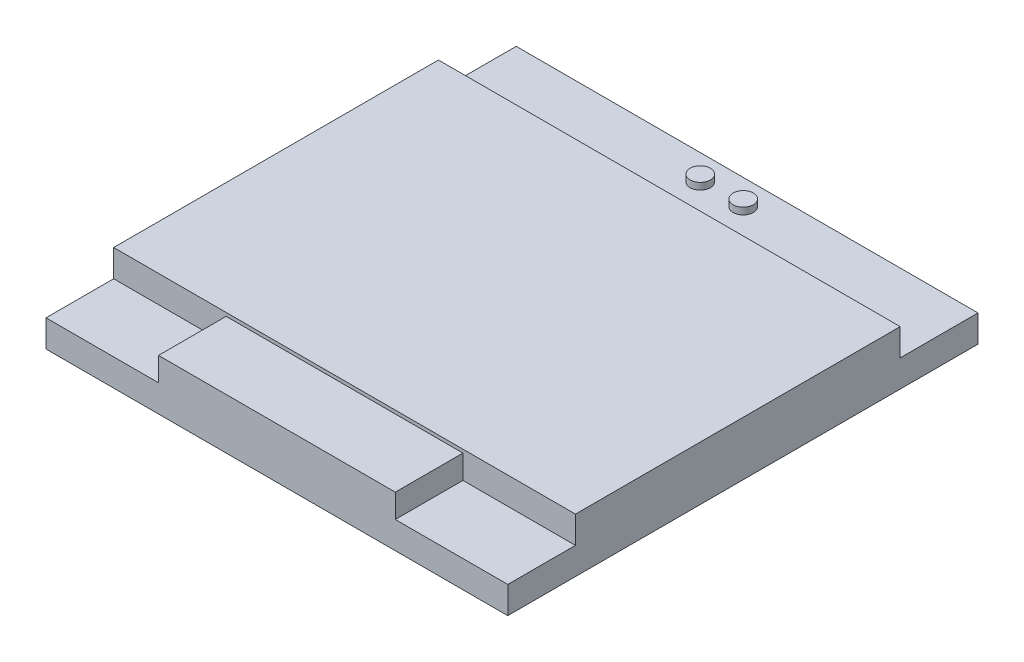
ISO-10303-21;
HEADER;
FILE_DESCRIPTION(('STEP AP214'),'2;1');
FILE_NAME('part.step','',(''),(''),'','','');
FILE_SCHEMA(('AUTOMOTIVE_DESIGN { 1 0 10303 214 1 1 1 1 }'));
ENDSEC;
DATA;
#1=APPLICATION_CONTEXT('core data for automotive mechanical design processes');
#2=APPLICATION_PROTOCOL_DEFINITION('international standard','automotive_design',2000,#1);
#3=PRODUCT_CONTEXT('',#1,'mechanical');
#4=PRODUCT('Part','Part','',(#3));
#5=PRODUCT_RELATED_PRODUCT_CATEGORY('part','',(#4));
#6=PRODUCT_DEFINITION_FORMATION('','',#4);
#7=PRODUCT_DEFINITION_CONTEXT('part definition',#1,'design');
#8=PRODUCT_DEFINITION('design','',#6,#7);
#9=PRODUCT_DEFINITION_SHAPE('','',#8);
#10=(LENGTH_UNIT() NAMED_UNIT(*) SI_UNIT(.MILLI.,.METRE.));
#11=(NAMED_UNIT(*) PLANE_ANGLE_UNIT() SI_UNIT($,.RADIAN.));
#12=(NAMED_UNIT(*) SI_UNIT($,.STERADIAN.) SOLID_ANGLE_UNIT());
#13=UNCERTAINTY_MEASURE_WITH_UNIT(LENGTH_MEASURE(1.E-05),#10,'distance_accuracy_value','');
#14=(GEOMETRIC_REPRESENTATION_CONTEXT(3) GLOBAL_UNCERTAINTY_ASSIGNED_CONTEXT((#13)) GLOBAL_UNIT_ASSIGNED_CONTEXT((#10,
#11,#12)) REPRESENTATION_CONTEXT('',''));
#15=CARTESIAN_POINT('',(0.,0.,0.));
#16=DIRECTION('',(0.,0.,1.));
#17=DIRECTION('',(1.,0.,0.));
#18=AXIS2_PLACEMENT_3D('',#15,#16,#17);
#19=CARTESIAN_POINT('',(0.,1.6,0.));
#20=DIRECTION('',(0.,-1.,0.));
#21=DIRECTION('',(0.,0.,-1.));
#22=AXIS2_PLACEMENT_3D('',#19,#20,#21);
#23=PLANE('',#22);
#24=DIRECTION('',(0.,0.,1.));
#25=VECTOR('',#24,1.);
#26=CARTESIAN_POINT('',(6.65,1.6,-4.));
#27=LINE('',#26,#25);
#28=CARTESIAN_POINT('',(6.65,1.6,-4.));
#29=VERTEX_POINT('',#28);
#30=CARTESIAN_POINT('',(6.65,1.6,0.));
#31=VERTEX_POINT('',#30);
#32=EDGE_CURVE('E142',#29,#31,#27,.T.);
#33=ORIENTED_EDGE('',*,*,#32,.F.);
#34=DIRECTION('',(1.,0.,0.));
#35=VECTOR('',#34,1.);
#36=CARTESIAN_POINT('',(0.,1.6,-4.));
#37=LINE('',#36,#35);
#38=CARTESIAN_POINT('',(0.,1.6,-4.));
#39=VERTEX_POINT('',#38);
#40=EDGE_CURVE('E170',#39,#29,#37,.T.);
#41=ORIENTED_EDGE('',*,*,#40,.F.);
#42=DIRECTION('',(0.,0.,1.));
#43=VECTOR('',#42,1.);
#44=CARTESIAN_POINT('',(0.,1.6,0.));
#45=LINE('',#44,#43);
#46=CARTESIAN_POINT('',(0.,1.6,0.));
#47=VERTEX_POINT('',#46);
#48=EDGE_CURVE('E208',#39,#47,#45,.T.);
#49=ORIENTED_EDGE('',*,*,#48,.T.);
#50=DIRECTION('',(1.,0.,0.));
#51=VECTOR('',#50,1.);
#52=CARTESIAN_POINT('',(0.,1.6,0.));
#53=LINE('',#52,#51);
#54=EDGE_CURVE('E209',#47,#31,#53,.T.);
#55=ORIENTED_EDGE('',*,*,#54,.T.);
#56=EDGE_LOOP('',(#33,#41,#49,#55));
#57=FACE_BOUND('',#56,.T.);
#58=ADVANCED_FACE('F39',(#57),#23,.F.);
#59=DIRECTION('',(0.,0.,-1.));
#60=VECTOR('',#59,1.);
#61=CARTESIAN_POINT('',(20.65,1.6,-4.));
#62=LINE('',#61,#60);
#63=CARTESIAN_POINT('',(20.65,1.6,0.));
#64=VERTEX_POINT('',#63);
#65=CARTESIAN_POINT('',(20.65,1.6,-4.));
#66=VERTEX_POINT('',#65);
#67=EDGE_CURVE('E155',#64,#66,#62,.T.);
#68=ORIENTED_EDGE('',*,*,#67,.F.);
#69=CARTESIAN_POINT('',(27.3,1.6,0.));
#70=VERTEX_POINT('',#69);
#71=EDGE_CURVE('E207',#64,#70,#53,.T.);
#72=ORIENTED_EDGE('',*,*,#71,.T.);
#73=DIRECTION('',(0.,0.,-1.));
#74=VECTOR('',#73,1.);
#75=CARTESIAN_POINT('',(27.3,1.6,0.));
#76=LINE('',#75,#74);
#77=CARTESIAN_POINT('',(27.3,1.6,-4.));
#78=VERTEX_POINT('',#77);
#79=EDGE_CURVE('E212',#70,#78,#76,.T.);
#80=ORIENTED_EDGE('',*,*,#79,.T.);
#81=EDGE_CURVE('E173',#66,#78,#37,.T.);
#82=ORIENTED_EDGE('',*,*,#81,.F.);
#83=EDGE_LOOP('',(#68,#72,#80,#82));
#84=FACE_BOUND('',#83,.T.);
#85=ADVANCED_FACE('F291',(#84),#23,.F.);
#86=CARTESIAN_POINT('',(0.,3.2,-4.));
#87=DIRECTION('',(0.,0.,-1.));
#88=DIRECTION('',(-1.,0.,0.));
#89=AXIS2_PLACEMENT_3D('',#86,#87,#88);
#90=PLANE('',#89);
#91=DIRECTION('',(0.,-1.,0.));
#92=VECTOR('',#91,1.);
#93=CARTESIAN_POINT('',(6.65,17.760219778561,-4.));
#94=LINE('',#93,#92);
#95=CARTESIAN_POINT('',(6.65,3.,-4.));
#96=VERTEX_POINT('',#95);
#97=EDGE_CURVE('E158',#96,#29,#94,.T.);
#98=ORIENTED_EDGE('',*,*,#97,.F.);
#99=DIRECTION('',(-1.,0.,0.));
#100=VECTOR('',#99,1.);
#101=CARTESIAN_POINT('',(6.65,3.,-4.));
#102=LINE('',#101,#100);
#103=CARTESIAN_POINT('',(20.65,3.,-4.));
#104=VERTEX_POINT('',#103);
#105=EDGE_CURVE('E147',#104,#96,#102,.T.);
#106=ORIENTED_EDGE('',*,*,#105,.F.);
#107=DIRECTION('',(0.,-1.,0.));
#108=VECTOR('',#107,1.);
#109=CARTESIAN_POINT('',(20.65,17.760219778561,-4.));
#110=LINE('',#109,#108);
#111=EDGE_CURVE('E150',#104,#66,#110,.T.);
#112=ORIENTED_EDGE('',*,*,#111,.T.);
#113=ORIENTED_EDGE('',*,*,#81,.T.);
#114=DIRECTION('',(0.,-1.,0.));
#115=VECTOR('',#114,1.);
#116=CARTESIAN_POINT('',(27.3,3.2,-4.));
#117=LINE('',#116,#115);
#118=CARTESIAN_POINT('',(27.3,3.2,-4.));
#119=VERTEX_POINT('',#118);
#120=EDGE_CURVE('E180',#119,#78,#117,.T.);
#121=ORIENTED_EDGE('',*,*,#120,.F.);
#122=DIRECTION('',(1.,0.,0.));
#123=VECTOR('',#122,1.);
#124=CARTESIAN_POINT('',(0.,3.2,-4.));
#125=LINE('',#124,#123);
#126=CARTESIAN_POINT('',(0.,3.2,-4.));
#127=VERTEX_POINT('',#126);
#128=EDGE_CURVE('E163',#127,#119,#125,.T.);
#129=ORIENTED_EDGE('',*,*,#128,.F.);
#130=DIRECTION('',(0.,-1.,0.));
#131=VECTOR('',#130,1.);
#132=CARTESIAN_POINT('',(0.,3.2,-4.));
#133=LINE('',#132,#131);
#134=EDGE_CURVE('E183',#127,#39,#133,.T.);
#135=ORIENTED_EDGE('',*,*,#134,.T.);
#136=ORIENTED_EDGE('',*,*,#40,.T.);
#137=EDGE_LOOP('',(#98,#106,#112,#113,#121,#129,#135,#136));
#138=FACE_BOUND('',#137,.T.);
#139=ADVANCED_FACE('F269',(#138),#90,.F.);
#140=CARTESIAN_POINT('',(14.92,1.6,-26.3));
#141=DIRECTION('',(0.,-1.,0.));
#142=DIRECTION('',(0.,0.,-1.));
#143=AXIS2_PLACEMENT_3D('',#140,#141,#142);
#144=CIRCLE('',#143,0.6);
#145=CARTESIAN_POINT('',(14.92,1.6,-26.9));
#146=VERTEX_POINT('',#145);
#147=EDGE_CURVE('E201',#146,#146,#144,.T.);
#148=ORIENTED_EDGE('',*,*,#147,.T.);
#149=EDGE_LOOP('',(#148));
#150=FACE_BOUND('',#149,.T.);
#151=CARTESIAN_POINT('',(12.38,1.6,-26.3));
#152=DIRECTION('',(0.,-1.,0.));
#153=DIRECTION('',(0.,0.,-1.));
#154=AXIS2_PLACEMENT_3D('',#151,#152,#153);
#155=CIRCLE('',#154,0.6);
#156=CARTESIAN_POINT('',(12.38,1.6,-26.9));
#157=VERTEX_POINT('',#156);
#158=EDGE_CURVE('E192',#157,#157,#155,.T.);
#159=ORIENTED_EDGE('',*,*,#158,.T.);
#160=EDGE_LOOP('',(#159));
#161=FACE_BOUND('',#160,.T.);
#162=DIRECTION('',(-1.,0.,0.));
#163=VECTOR('',#162,1.);
#164=CARTESIAN_POINT('',(0.,1.6,-23.2));
#165=LINE('',#164,#163);
#166=CARTESIAN_POINT('',(27.3,1.6,-23.2));
#167=VERTEX_POINT('',#166);
#168=CARTESIAN_POINT('',(0.,1.6,-23.2));
#169=VERTEX_POINT('',#168);
#170=EDGE_CURVE('E62',#167,#169,#165,.T.);
#171=ORIENTED_EDGE('',*,*,#170,.F.);
#172=CARTESIAN_POINT('',(27.3,1.6,-27.8));
#173=VERTEX_POINT('',#172);
#174=EDGE_CURVE('E211',#167,#173,#76,.T.);
#175=ORIENTED_EDGE('',*,*,#174,.T.);
#176=DIRECTION('',(-1.,0.,0.));
#177=VECTOR('',#176,1.);
#178=CARTESIAN_POINT('',(0.,1.6,-27.8));
#179=LINE('',#178,#177);
#180=CARTESIAN_POINT('',(0.,1.6,-27.8));
#181=VERTEX_POINT('',#180);
#182=EDGE_CURVE('E215',#173,#181,#179,.T.);
#183=ORIENTED_EDGE('',*,*,#182,.T.);
#184=EDGE_CURVE('E205',#181,#169,#45,.T.);
#185=ORIENTED_EDGE('',*,*,#184,.T.);
#186=EDGE_LOOP('',(#171,#175,#183,#185));
#187=FACE_BOUND('',#186,.T.);
#188=ADVANCED_FACE('F293',(#150,#161,#187),#23,.F.);
#189=CARTESIAN_POINT('',(0.,1.6,0.));
#190=DIRECTION('',(1.,0.,0.));
#191=DIRECTION('',(0.,0.,-1.));
#192=AXIS2_PLACEMENT_3D('',#189,#190,#191);
#193=PLANE('',#192);
#194=DIRECTION('',(0.,0.,1.));
#195=VECTOR('',#194,1.);
#196=CARTESIAN_POINT('',(0.,0.,0.));
#197=LINE('',#196,#195);
#198=CARTESIAN_POINT('',(0.,0.,-27.8));
#199=VERTEX_POINT('',#198);
#200=CARTESIAN_POINT('',(0.,0.,0.));
#201=VERTEX_POINT('',#200);
#202=EDGE_CURVE('E204',#199,#201,#197,.T.);
#203=ORIENTED_EDGE('',*,*,#202,.T.);
#204=DIRECTION('',(0.,-1.,0.));
#205=VECTOR('',#204,1.);
#206=CARTESIAN_POINT('',(0.,1.6,0.));
#207=LINE('',#206,#205);
#208=EDGE_CURVE('E234',#47,#201,#207,.T.);
#209=ORIENTED_EDGE('',*,*,#208,.F.);
#210=ORIENTED_EDGE('',*,*,#48,.F.);
#211=ORIENTED_EDGE('',*,*,#134,.F.);
#212=DIRECTION('',(0.,0.,1.));
#213=VECTOR('',#212,1.);
#214=CARTESIAN_POINT('',(0.,3.2,-23.2));
#215=LINE('',#214,#213);
#216=CARTESIAN_POINT('',(0.,3.2,-23.2));
#217=VERTEX_POINT('',#216);
#218=EDGE_CURVE('E160',#217,#127,#215,.T.);
#219=ORIENTED_EDGE('',*,*,#218,.F.);
#220=DIRECTION('',(0.,-1.,0.));
#221=VECTOR('',#220,1.);
#222=CARTESIAN_POINT('',(0.,3.2,-23.2));
#223=LINE('',#222,#221);
#224=EDGE_CURVE('E169',#217,#169,#223,.T.);
#225=ORIENTED_EDGE('',*,*,#224,.T.);
#226=ORIENTED_EDGE('',*,*,#184,.F.);
#227=DIRECTION('',(0.,-1.,0.));
#228=VECTOR('',#227,1.);
#229=CARTESIAN_POINT('',(0.,1.6,-27.8));
#230=LINE('',#229,#228);
#231=EDGE_CURVE('E217',#181,#199,#230,.T.);
#232=ORIENTED_EDGE('',*,*,#231,.T.);
#233=EDGE_LOOP('',(#203,#209,#210,#211,#219,#225,#226,#232));
#234=FACE_BOUND('',#233,.T.);
#235=ADVANCED_FACE('F41',(#234),#193,.F.);
#236=CARTESIAN_POINT('',(0.,1.6,0.));
#237=DIRECTION('',(0.,0.,-1.));
#238=DIRECTION('',(-1.,0.,0.));
#239=AXIS2_PLACEMENT_3D('',#236,#237,#238);
#240=PLANE('',#239);
#241=DIRECTION('',(1.,0.,0.));
#242=VECTOR('',#241,1.);
#243=CARTESIAN_POINT('',(0.,0.,0.));
#244=LINE('',#243,#242);
#245=CARTESIAN_POINT('',(27.3,0.,0.));
#246=VERTEX_POINT('',#245);
#247=EDGE_CURVE('E220',#201,#246,#244,.T.);
#248=ORIENTED_EDGE('',*,*,#247,.T.);
#249=DIRECTION('',(0.,-1.,0.));
#250=VECTOR('',#249,1.);
#251=CARTESIAN_POINT('',(27.3,1.6,0.));
#252=LINE('',#251,#250);
#253=EDGE_CURVE('E231',#70,#246,#252,.T.);
#254=ORIENTED_EDGE('',*,*,#253,.F.);
#255=ORIENTED_EDGE('',*,*,#71,.F.);
#256=DIRECTION('',(0.,-1.,0.));
#257=VECTOR('',#256,1.);
#258=CARTESIAN_POINT('',(20.65,17.760219778561,0.));
#259=LINE('',#258,#257);
#260=CARTESIAN_POINT('',(20.65,3.,0.));
#261=VERTEX_POINT('',#260);
#262=EDGE_CURVE('E135',#261,#64,#259,.T.);
#263=ORIENTED_EDGE('',*,*,#262,.F.);
#264=DIRECTION('',(1.,0.,0.));
#265=VECTOR('',#264,1.);
#266=CARTESIAN_POINT('',(6.65,3.,0.));
#267=LINE('',#266,#265);
#268=CARTESIAN_POINT('',(6.65,3.,0.));
#269=VERTEX_POINT('',#268);
#270=EDGE_CURVE('E128',#269,#261,#267,.T.);
#271=ORIENTED_EDGE('',*,*,#270,.F.);
#272=DIRECTION('',(0.,-1.,0.));
#273=VECTOR('',#272,1.);
#274=CARTESIAN_POINT('',(6.65,17.760219778561,0.));
#275=LINE('',#274,#273);
#276=EDGE_CURVE('E132',#269,#31,#275,.T.);
#277=ORIENTED_EDGE('',*,*,#276,.T.);
#278=ORIENTED_EDGE('',*,*,#54,.F.);
#279=ORIENTED_EDGE('',*,*,#208,.T.);
#280=EDGE_LOOP('',(#248,#254,#255,#263,#271,#277,#278,#279));
#281=FACE_BOUND('',#280,.T.);
#282=ADVANCED_FACE('F130',(#281),#240,.F.);
#283=CARTESIAN_POINT('',(27.3,1.6,0.));
#284=DIRECTION('',(-1.,0.,0.));
#285=DIRECTION('',(0.,0.,1.));
#286=AXIS2_PLACEMENT_3D('',#283,#284,#285);
#287=PLANE('',#286);
#288=DIRECTION('',(0.,0.,-1.));
#289=VECTOR('',#288,1.);
#290=CARTESIAN_POINT('',(27.3,0.,0.));
#291=LINE('',#290,#289);
#292=CARTESIAN_POINT('',(27.3,0.,-27.8));
#293=VERTEX_POINT('',#292);
#294=EDGE_CURVE('E222',#246,#293,#291,.T.);
#295=ORIENTED_EDGE('',*,*,#294,.T.);
#296=DIRECTION('',(0.,-1.,0.));
#297=VECTOR('',#296,1.);
#298=CARTESIAN_POINT('',(27.3,1.6,-27.8));
#299=LINE('',#298,#297);
#300=EDGE_CURVE('E228',#173,#293,#299,.T.);
#301=ORIENTED_EDGE('',*,*,#300,.F.);
#302=ORIENTED_EDGE('',*,*,#174,.F.);
#303=DIRECTION('',(0.,-1.,0.));
#304=VECTOR('',#303,1.);
#305=CARTESIAN_POINT('',(27.3,3.2,-23.2));
#306=LINE('',#305,#304);
#307=CARTESIAN_POINT('',(27.3,3.2,-23.2));
#308=VERTEX_POINT('',#307);
#309=EDGE_CURVE('E177',#308,#167,#306,.T.);
#310=ORIENTED_EDGE('',*,*,#309,.F.);
#311=DIRECTION('',(0.,0.,-1.));
#312=VECTOR('',#311,1.);
#313=CARTESIAN_POINT('',(27.3,3.2,-23.2));
#314=LINE('',#313,#312);
#315=EDGE_CURVE('E165',#119,#308,#314,.T.);
#316=ORIENTED_EDGE('',*,*,#315,.F.);
#317=ORIENTED_EDGE('',*,*,#120,.T.);
#318=ORIENTED_EDGE('',*,*,#79,.F.);
#319=ORIENTED_EDGE('',*,*,#253,.T.);
#320=EDGE_LOOP('',(#295,#301,#302,#310,#316,#317,#318,#319));
#321=FACE_BOUND('',#320,.T.);
#322=ADVANCED_FACE('F261',(#321),#287,.F.);
#323=CARTESIAN_POINT('',(0.,1.6,-27.8));
#324=DIRECTION('',(0.,0.,1.));
#325=DIRECTION('',(1.,0.,0.));
#326=AXIS2_PLACEMENT_3D('',#323,#324,#325);
#327=PLANE('',#326);
#328=DIRECTION('',(-1.,0.,0.));
#329=VECTOR('',#328,1.);
#330=CARTESIAN_POINT('',(0.,0.,-27.8));
#331=LINE('',#330,#329);
#332=EDGE_CURVE('E224',#293,#199,#331,.T.);
#333=ORIENTED_EDGE('',*,*,#332,.T.);
#334=ORIENTED_EDGE('',*,*,#231,.F.);
#335=ORIENTED_EDGE('',*,*,#182,.F.);
#336=ORIENTED_EDGE('',*,*,#300,.T.);
#337=EDGE_LOOP('',(#333,#334,#335,#336));
#338=FACE_BOUND('',#337,.T.);
#339=ADVANCED_FACE('F246',(#338),#327,.F.);
#340=CARTESIAN_POINT('',(0.,0.,0.));
#341=DIRECTION('',(0.,-1.,0.));
#342=DIRECTION('',(0.,0.,-1.));
#343=AXIS2_PLACEMENT_3D('',#340,#341,#342);
#344=PLANE('',#343);
#345=CARTESIAN_POINT('',(12.38,0.,-26.3));
#346=DIRECTION('',(0.,-1.,0.));
#347=DIRECTION('',(0.,0.,-1.));
#348=AXIS2_PLACEMENT_3D('',#345,#346,#347);
#349=CIRCLE('',#348,0.6);
#350=CARTESIAN_POINT('',(12.38,0.,-26.9));
#351=VERTEX_POINT('',#350);
#352=EDGE_CURVE('E12',#351,#351,#349,.T.);
#353=ORIENTED_EDGE('',*,*,#352,.F.);
#354=EDGE_LOOP('',(#353));
#355=FACE_BOUND('',#354,.T.);
#356=CARTESIAN_POINT('',(14.92,0.,-26.3));
#357=DIRECTION('',(0.,-1.,0.));
#358=DIRECTION('',(0.,0.,-1.));
#359=AXIS2_PLACEMENT_3D('',#356,#357,#358);
#360=CIRCLE('',#359,0.6);
#361=CARTESIAN_POINT('',(14.92,0.,-26.9));
#362=VERTEX_POINT('',#361);
#363=EDGE_CURVE('E47',#362,#362,#360,.T.);
#364=ORIENTED_EDGE('',*,*,#363,.F.);
#365=EDGE_LOOP('',(#364));
#366=FACE_BOUND('',#365,.T.);
#367=ORIENTED_EDGE('',*,*,#202,.F.);
#368=ORIENTED_EDGE('',*,*,#332,.F.);
#369=ORIENTED_EDGE('',*,*,#294,.F.);
#370=ORIENTED_EDGE('',*,*,#247,.F.);
#371=EDGE_LOOP('',(#367,#368,#369,#370));
#372=FACE_BOUND('',#371,.T.);
#373=ADVANCED_FACE('F242',(#355,#366,#372),#344,.T.);
#374=CARTESIAN_POINT('',(0.,-4.9,0.));
#375=DIRECTION('',(0.,-1.,0.));
#376=DIRECTION('',(0.,0.,-1.));
#377=AXIS2_PLACEMENT_3D('',#374,#375,#376);
#378=PLANE('',#377);
#379=CARTESIAN_POINT('',(14.92,-4.9,-26.3));
#380=DIRECTION('',(0.,-1.,0.));
#381=DIRECTION('',(0.,0.,-1.));
#382=AXIS2_PLACEMENT_3D('',#379,#380,#381);
#383=CIRCLE('',#382,0.6);
#384=CARTESIAN_POINT('',(14.92,-4.9,-26.9));
#385=VERTEX_POINT('',#384);
#386=EDGE_CURVE('E195',#385,#385,#383,.T.);
#387=ORIENTED_EDGE('',*,*,#386,.T.);
#388=EDGE_LOOP('',(#387));
#389=FACE_BOUND('',#388,.T.);
#390=ADVANCED_FACE('F245',(#389),#378,.T.);
#391=CARTESIAN_POINT('',(14.92,2.,-26.3));
#392=DIRECTION('',(0.,-1.,0.));
#393=DIRECTION('',(0.,0.,-1.));
#394=AXIS2_PLACEMENT_3D('',#391,#392,#393);
#395=CYLINDRICAL_SURFACE('',#394,0.6);
#396=ORIENTED_EDGE('',*,*,#363,.T.);
#397=EDGE_LOOP('',(#396));
#398=FACE_BOUND('',#397,.T.);
#399=ORIENTED_EDGE('',*,*,#386,.F.);
#400=EDGE_LOOP('',(#399));
#401=FACE_BOUND('',#400,.T.);
#402=ADVANCED_FACE('F239',(#398,#401),#395,.T.);
#403=CARTESIAN_POINT('',(14.92,2.,-26.3));
#404=DIRECTION('',(0.,-1.,0.));
#405=DIRECTION('',(0.,0.,-1.));
#406=AXIS2_PLACEMENT_3D('',#403,#404,#405);
#407=CIRCLE('',#406,0.6);
#408=CARTESIAN_POINT('',(14.92,2.,-26.9));
#409=VERTEX_POINT('',#408);
#410=EDGE_CURVE('E198',#409,#409,#407,.T.);
#411=ORIENTED_EDGE('',*,*,#410,.T.);
#412=EDGE_LOOP('',(#411));
#413=FACE_BOUND('',#412,.T.);
#414=ORIENTED_EDGE('',*,*,#147,.F.);
#415=EDGE_LOOP('',(#414));
#416=FACE_BOUND('',#415,.T.);
#417=ADVANCED_FACE('F326',(#413,#416),#395,.T.);
#418=CARTESIAN_POINT('',(14.92,2.,-26.3));
#419=DIRECTION('',(0.,-1.,0.));
#420=DIRECTION('',(0.,0.,-1.));
#421=AXIS2_PLACEMENT_3D('',#418,#419,#420);
#422=PLANE('',#421);
#423=ORIENTED_EDGE('',*,*,#410,.F.);
#424=EDGE_LOOP('',(#423));
#425=FACE_BOUND('',#424,.T.);
#426=ADVANCED_FACE('F324',(#425),#422,.F.);
#427=CARTESIAN_POINT('',(0.,-4.9,0.));
#428=DIRECTION('',(0.,-1.,0.));
#429=DIRECTION('',(0.,0.,-1.));
#430=AXIS2_PLACEMENT_3D('',#427,#428,#429);
#431=PLANE('',#430);
#432=CARTESIAN_POINT('',(12.38,-4.9,-26.3));
#433=DIRECTION('',(0.,-1.,0.));
#434=DIRECTION('',(0.,0.,-1.));
#435=AXIS2_PLACEMENT_3D('',#432,#433,#434);
#436=CIRCLE('',#435,0.6);
#437=CARTESIAN_POINT('',(12.38,-4.9,-26.9));
#438=VERTEX_POINT('',#437);
#439=EDGE_CURVE('E186',#438,#438,#436,.T.);
#440=ORIENTED_EDGE('',*,*,#439,.T.);
#441=EDGE_LOOP('',(#440));
#442=FACE_BOUND('',#441,.T.);
#443=ADVANCED_FACE('F317',(#442),#431,.T.);
#444=CARTESIAN_POINT('',(12.38,2.,-26.3));
#445=DIRECTION('',(0.,-1.,0.));
#446=DIRECTION('',(0.,0.,-1.));
#447=AXIS2_PLACEMENT_3D('',#444,#445,#446);
#448=CYLINDRICAL_SURFACE('',#447,0.6);
#449=ORIENTED_EDGE('',*,*,#352,.T.);
#450=EDGE_LOOP('',(#449));
#451=FACE_BOUND('',#450,.T.);
#452=ORIENTED_EDGE('',*,*,#439,.F.);
#453=EDGE_LOOP('',(#452));
#454=FACE_BOUND('',#453,.T.);
#455=ADVANCED_FACE('F311',(#451,#454),#448,.T.);
#456=CARTESIAN_POINT('',(12.38,2.,-26.3));
#457=DIRECTION('',(0.,-1.,0.));
#458=DIRECTION('',(0.,0.,-1.));
#459=AXIS2_PLACEMENT_3D('',#456,#457,#458);
#460=CIRCLE('',#459,0.6);
#461=CARTESIAN_POINT('',(12.38,2.,-26.9));
#462=VERTEX_POINT('',#461);
#463=EDGE_CURVE('E189',#462,#462,#460,.T.);
#464=ORIENTED_EDGE('',*,*,#463,.T.);
#465=EDGE_LOOP('',(#464));
#466=FACE_BOUND('',#465,.T.);
#467=ORIENTED_EDGE('',*,*,#158,.F.);
#468=EDGE_LOOP('',(#467));
#469=FACE_BOUND('',#468,.T.);
#470=ADVANCED_FACE('F286',(#466,#469),#448,.T.);
#471=CARTESIAN_POINT('',(12.38,2.,-26.3));
#472=DIRECTION('',(0.,-1.,0.));
#473=DIRECTION('',(0.,0.,-1.));
#474=AXIS2_PLACEMENT_3D('',#471,#472,#473);
#475=PLANE('',#474);
#476=ORIENTED_EDGE('',*,*,#463,.F.);
#477=EDGE_LOOP('',(#476));
#478=FACE_BOUND('',#477,.T.);
#479=ADVANCED_FACE('F279',(#478),#475,.F.);
#480=CARTESIAN_POINT('',(0.,3.2,-23.2));
#481=DIRECTION('',(0.,0.,1.));
#482=DIRECTION('',(1.,0.,0.));
#483=AXIS2_PLACEMENT_3D('',#480,#481,#482);
#484=PLANE('',#483);
#485=ORIENTED_EDGE('',*,*,#170,.T.);
#486=ORIENTED_EDGE('',*,*,#224,.F.);
#487=DIRECTION('',(-1.,0.,0.));
#488=VECTOR('',#487,1.);
#489=CARTESIAN_POINT('',(0.,3.2,-23.2));
#490=LINE('',#489,#488);
#491=EDGE_CURVE('E167',#308,#217,#490,.T.);
#492=ORIENTED_EDGE('',*,*,#491,.F.);
#493=ORIENTED_EDGE('',*,*,#309,.T.);
#494=EDGE_LOOP('',(#485,#486,#492,#493));
#495=FACE_BOUND('',#494,.T.);
#496=ADVANCED_FACE('F277',(#495),#484,.F.);
#497=CARTESIAN_POINT('',(0.,3.2,0.));
#498=DIRECTION('',(0.,1.,0.));
#499=DIRECTION('',(0.,0.,1.));
#500=AXIS2_PLACEMENT_3D('',#497,#498,#499);
#501=PLANE('',#500);
#502=ORIENTED_EDGE('',*,*,#218,.T.);
#503=ORIENTED_EDGE('',*,*,#128,.T.);
#504=ORIENTED_EDGE('',*,*,#315,.T.);
#505=ORIENTED_EDGE('',*,*,#491,.T.);
#506=EDGE_LOOP('',(#502,#503,#504,#505));
#507=FACE_BOUND('',#506,.T.);
#508=ADVANCED_FACE('F273',(#507),#501,.T.);
#509=CARTESIAN_POINT('',(6.65,17.760219778561,-4.));
#510=DIRECTION('',(1.,0.,0.));
#511=DIRECTION('',(0.,0.,-1.));
#512=AXIS2_PLACEMENT_3D('',#509,#510,#511);
#513=PLANE('',#512);
#514=DIRECTION('',(0.,0.,1.));
#515=VECTOR('',#514,1.);
#516=CARTESIAN_POINT('',(6.65,3.,-4.));
#517=LINE('',#516,#515);
#518=EDGE_CURVE('E137',#96,#269,#517,.T.);
#519=ORIENTED_EDGE('',*,*,#518,.F.);
#520=ORIENTED_EDGE('',*,*,#97,.T.);
#521=ORIENTED_EDGE('',*,*,#32,.T.);
#522=ORIENTED_EDGE('',*,*,#276,.F.);
#523=EDGE_LOOP('',(#519,#520,#521,#522));
#524=FACE_BOUND('',#523,.T.);
#525=ADVANCED_FACE('F140',(#524),#513,.F.);
#526=CARTESIAN_POINT('',(20.65,17.760219778561,-4.));
#527=DIRECTION('',(-1.,0.,0.));
#528=DIRECTION('',(0.,0.,1.));
#529=AXIS2_PLACEMENT_3D('',#526,#527,#528);
#530=PLANE('',#529);
#531=DIRECTION('',(0.,0.,-1.));
#532=VECTOR('',#531,1.);
#533=CARTESIAN_POINT('',(20.65,3.,-4.));
#534=LINE('',#533,#532);
#535=EDGE_CURVE('E54',#261,#104,#534,.T.);
#536=ORIENTED_EDGE('',*,*,#535,.F.);
#537=ORIENTED_EDGE('',*,*,#262,.T.);
#538=ORIENTED_EDGE('',*,*,#67,.T.);
#539=ORIENTED_EDGE('',*,*,#111,.F.);
#540=EDGE_LOOP('',(#536,#537,#538,#539));
#541=FACE_BOUND('',#540,.T.);
#542=ADVANCED_FACE('F421',(#541),#530,.F.);
#543=CARTESIAN_POINT('',(0.,3.,0.));
#544=DIRECTION('',(0.,1.,0.));
#545=DIRECTION('',(0.,0.,1.));
#546=AXIS2_PLACEMENT_3D('',#543,#544,#545);
#547=PLANE('',#546);
#548=ORIENTED_EDGE('',*,*,#105,.T.);
#549=ORIENTED_EDGE('',*,*,#518,.T.);
#550=ORIENTED_EDGE('',*,*,#270,.T.);
#551=ORIENTED_EDGE('',*,*,#535,.T.);
#552=EDGE_LOOP('',(#548,#549,#550,#551));
#553=FACE_BOUND('',#552,.T.);
#554=ADVANCED_FACE('F145',(#553),#547,.T.);
#555=CLOSED_SHELL('',(#58,#85,#139,#188,#235,#282,#322,#339,#373,#390,#402,#417,#426,#443,#455,
#470,#479,#496,#508,#525,#542,#554));
#556=MANIFOLD_SOLID_BREP('B2',#555);
#557=ADVANCED_BREP_SHAPE_REPRESENTATION('',(#18,#556),#14);
#558=SHAPE_DEFINITION_REPRESENTATION(#9,#557);
ENDSEC;
END-ISO-10303-21;
